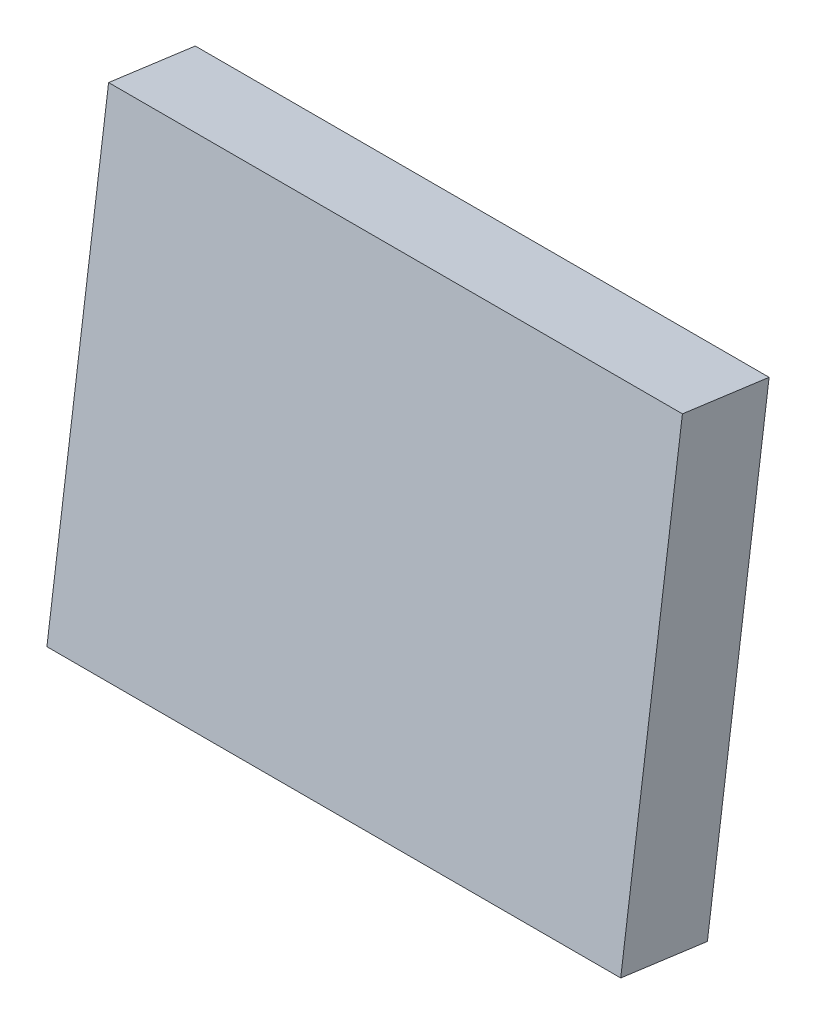
ISO-10303-21;
HEADER;
FILE_DESCRIPTION(('STEP AP214'),'2;1');
FILE_NAME('part.step','',(''),(''),'','','');
FILE_SCHEMA(('AUTOMOTIVE_DESIGN { 1 0 10303 214 1 1 1 1 }'));
ENDSEC;
DATA;
#1=APPLICATION_CONTEXT('core data for automotive mechanical design processes');
#2=APPLICATION_PROTOCOL_DEFINITION('international standard','automotive_design',2000,#1);
#3=PRODUCT_CONTEXT('',#1,'mechanical');
#4=PRODUCT('Part','Part','',(#3));
#5=PRODUCT_RELATED_PRODUCT_CATEGORY('part','',(#4));
#6=PRODUCT_DEFINITION_FORMATION('','',#4);
#7=PRODUCT_DEFINITION_CONTEXT('part definition',#1,'design');
#8=PRODUCT_DEFINITION('design','',#6,#7);
#9=PRODUCT_DEFINITION_SHAPE('','',#8);
#10=(LENGTH_UNIT() NAMED_UNIT(*) SI_UNIT(.MILLI.,.METRE.));
#11=(NAMED_UNIT(*) PLANE_ANGLE_UNIT() SI_UNIT($,.RADIAN.));
#12=(NAMED_UNIT(*) SI_UNIT($,.STERADIAN.) SOLID_ANGLE_UNIT());
#13=UNCERTAINTY_MEASURE_WITH_UNIT(LENGTH_MEASURE(1.E-05),#10,'distance_accuracy_value','');
#14=(GEOMETRIC_REPRESENTATION_CONTEXT(3) GLOBAL_UNCERTAINTY_ASSIGNED_CONTEXT((#13)) GLOBAL_UNIT_ASSIGNED_CONTEXT((#10,
#11,#12)) REPRESENTATION_CONTEXT('',''));
#15=CARTESIAN_POINT('',(0.,0.,0.));
#16=DIRECTION('',(0.,0.,1.));
#17=DIRECTION('',(1.,0.,0.));
#18=AXIS2_PLACEMENT_3D('',#15,#16,#17);
#19=CARTESIAN_POINT('',(-68.5919402962882,-126.218111745127,-943.902118141965));
#20=DIRECTION('',(0.,-0.99103456450642,0.133605733236152));
#21=DIRECTION('',(0.,-0.133605733236152,-0.99103456450642));
#22=AXIS2_PLACEMENT_3D('',#19,#20,#21);
#23=PLANE('',#22);
#24=DIRECTION('',(1.,0.,0.));
#25=VECTOR('',#24,1.);
#26=CARTESIAN_POINT('',(-68.5919402962882,-125.550083078947,-938.946945319433));
#27=LINE('',#26,#25);
#28=CARTESIAN_POINT('',(-68.5919402962882,-125.550083078947,-938.946945319433));
#29=VERTEX_POINT('',#28);
#30=CARTESIAN_POINT('',(-35.7919402962882,-125.550083078947,-938.946945319433));
#31=VERTEX_POINT('',#30);
#32=EDGE_CURVE('E96',#29,#31,#27,.T.);
#33=ORIENTED_EDGE('',*,*,#32,.T.);
#34=DIRECTION('',(0.,0.133605733236152,0.99103456450642));
#35=VECTOR('',#34,1.);
#36=CARTESIAN_POINT('',(-35.7919402962882,-126.218111745127,-943.902118141965));
#37=LINE('',#36,#35);
#38=CARTESIAN_POINT('',(-35.7919402962882,-126.218111745127,-943.902118141965));
#39=VERTEX_POINT('',#38);
#40=EDGE_CURVE('E11',#39,#31,#37,.T.);
#41=ORIENTED_EDGE('',*,*,#40,.F.);
#42=DIRECTION('',(1.,0.,0.));
#43=VECTOR('',#42,1.);
#44=CARTESIAN_POINT('',(-68.5919402962882,-126.218111745127,-943.902118141965));
#45=LINE('',#44,#43);
#46=CARTESIAN_POINT('',(-68.5919402962882,-126.218111745127,-943.902118141965));
#47=VERTEX_POINT('',#46);
#48=EDGE_CURVE('E84',#47,#39,#45,.T.);
#49=ORIENTED_EDGE('',*,*,#48,.F.);
#50=DIRECTION('',(0.,0.133605733236152,0.99103456450642));
#51=VECTOR('',#50,1.);
#52=CARTESIAN_POINT('',(-68.5919402962882,-126.218111745127,-943.902118141965));
#53=LINE('',#52,#51);
#54=EDGE_CURVE('E92',#47,#29,#53,.T.);
#55=ORIENTED_EDGE('',*,*,#54,.T.);
#56=EDGE_LOOP('',(#33,#41,#49,#55));
#57=FACE_BOUND('',#56,.T.);
#58=ADVANCED_FACE('F33',(#57),#23,.F.);
#59=CARTESIAN_POINT('',(-35.7919402962882,-126.218111745127,-943.902118141965));
#60=DIRECTION('',(-1.,0.,0.));
#61=DIRECTION('',(0.,0.,1.));
#62=AXIS2_PLACEMENT_3D('',#59,#60,#61);
#63=PLANE('',#62);
#64=DIRECTION('',(0.,-0.99103456450642,0.133605733236152));
#65=VECTOR('',#64,1.);
#66=CARTESIAN_POINT('',(-35.7919402962882,-125.550083078947,-938.946945319433));
#67=LINE('',#66,#65);
#68=CARTESIAN_POINT('',(-35.7919402962882,-151.713395581916,-935.419753961999));
#69=VERTEX_POINT('',#68);
#70=EDGE_CURVE('E88',#31,#69,#67,.T.);
#71=ORIENTED_EDGE('',*,*,#70,.T.);
#72=DIRECTION('',(0.,0.133605733236152,0.99103456450642));
#73=VECTOR('',#72,1.);
#74=CARTESIAN_POINT('',(-35.7919402962882,-152.381424248097,-940.374926784531));
#75=LINE('',#74,#73);
#76=CARTESIAN_POINT('',(-35.7919402962882,-152.381424248097,-940.374926784531));
#77=VERTEX_POINT('',#76);
#78=EDGE_CURVE('E41',#77,#69,#75,.T.);
#79=ORIENTED_EDGE('',*,*,#78,.F.);
#80=DIRECTION('',(0.,-0.99103456450642,0.133605733236152));
#81=VECTOR('',#80,1.);
#82=CARTESIAN_POINT('',(-35.7919402962882,-126.218111745127,-943.902118141965));
#83=LINE('',#82,#81);
#84=EDGE_CURVE('E79',#39,#77,#83,.T.);
#85=ORIENTED_EDGE('',*,*,#84,.F.);
#86=ORIENTED_EDGE('',*,*,#40,.T.);
#87=EDGE_LOOP('',(#71,#79,#85,#86));
#88=FACE_BOUND('',#87,.T.);
#89=ADVANCED_FACE('F87',(#88),#63,.F.);
#90=CARTESIAN_POINT('',(-68.5919402962882,-152.381424248097,-940.374926784531));
#91=DIRECTION('',(0.,0.99103456450642,-0.133605733236152));
#92=DIRECTION('',(0.,0.133605733236152,0.99103456450642));
#93=AXIS2_PLACEMENT_3D('',#90,#91,#92);
#94=PLANE('',#93);
#95=DIRECTION('',(-1.,0.,0.));
#96=VECTOR('',#95,1.);
#97=CARTESIAN_POINT('',(-68.5919402962882,-151.713395581916,-935.419753961999));
#98=LINE('',#97,#96);
#99=CARTESIAN_POINT('',(-68.5919402962882,-151.713395581916,-935.419753961999));
#100=VERTEX_POINT('',#99);
#101=EDGE_CURVE('E66',#69,#100,#98,.T.);
#102=ORIENTED_EDGE('',*,*,#101,.T.);
#103=DIRECTION('',(0.,0.133605733236152,0.99103456450642));
#104=VECTOR('',#103,1.);
#105=CARTESIAN_POINT('',(-68.5919402962882,-152.381424248097,-940.374926784531));
#106=LINE('',#105,#104);
#107=CARTESIAN_POINT('',(-68.5919402962882,-152.381424248097,-940.374926784531));
#108=VERTEX_POINT('',#107);
#109=EDGE_CURVE('E89',#108,#100,#106,.T.);
#110=ORIENTED_EDGE('',*,*,#109,.F.);
#111=DIRECTION('',(-1.,0.,0.));
#112=VECTOR('',#111,1.);
#113=CARTESIAN_POINT('',(-68.5919402962882,-152.381424248097,-940.374926784531));
#114=LINE('',#113,#112);
#115=EDGE_CURVE('E82',#77,#108,#114,.T.);
#116=ORIENTED_EDGE('',*,*,#115,.F.);
#117=ORIENTED_EDGE('',*,*,#78,.T.);
#118=EDGE_LOOP('',(#102,#110,#116,#117));
#119=FACE_BOUND('',#118,.T.);
#120=ADVANCED_FACE('F90',(#119),#94,.F.);
#121=CARTESIAN_POINT('',(-68.5919402962882,-126.218111745127,-943.902118141965));
#122=DIRECTION('',(1.,0.,0.));
#123=DIRECTION('',(0.,0.,-1.));
#124=AXIS2_PLACEMENT_3D('',#121,#122,#123);
#125=PLANE('',#124);
#126=DIRECTION('',(0.,0.99103456450642,-0.133605733236152));
#127=VECTOR('',#126,1.);
#128=CARTESIAN_POINT('',(-68.5919402962882,-125.550083078947,-938.946945319433));
#129=LINE('',#128,#127);
#130=EDGE_CURVE('E72',#100,#29,#129,.T.);
#131=ORIENTED_EDGE('',*,*,#130,.T.);
#132=ORIENTED_EDGE('',*,*,#54,.F.);
#133=DIRECTION('',(0.,0.99103456450642,-0.133605733236152));
#134=VECTOR('',#133,1.);
#135=CARTESIAN_POINT('',(-68.5919402962882,-126.218111745127,-943.902118141965));
#136=LINE('',#135,#134);
#137=EDGE_CURVE('E49',#108,#47,#136,.T.);
#138=ORIENTED_EDGE('',*,*,#137,.F.);
#139=ORIENTED_EDGE('',*,*,#109,.T.);
#140=EDGE_LOOP('',(#131,#132,#138,#139));
#141=FACE_BOUND('',#140,.T.);
#142=ADVANCED_FACE('F103',(#141),#125,.F.);
#143=CARTESIAN_POINT('',(-3.30394039503722E-12,-127.233152329533,-943.765276051487));
#144=DIRECTION('',(0.,-0.133605733236152,-0.991034564506421));
#145=DIRECTION('',(0.,0.99103456450642,-0.133605733236152));
#146=AXIS2_PLACEMENT_3D('',#143,#144,#145);
#147=PLANE('',#146);
#148=ORIENTED_EDGE('',*,*,#48,.T.);
#149=ORIENTED_EDGE('',*,*,#84,.T.);
#150=ORIENTED_EDGE('',*,*,#115,.T.);
#151=ORIENTED_EDGE('',*,*,#137,.T.);
#152=EDGE_LOOP('',(#148,#149,#150,#151));
#153=FACE_BOUND('',#152,.T.);
#154=ADVANCED_FACE('F80',(#153),#147,.T.);
#155=CARTESIAN_POINT('',(-3.28480936267348E-12,-126.565123663352,-938.810103228955));
#156=DIRECTION('',(0.,-0.133605733236152,-0.991034564506421));
#157=DIRECTION('',(0.,0.99103456450642,-0.133605733236152));
#158=AXIS2_PLACEMENT_3D('',#155,#156,#157);
#159=PLANE('',#158);
#160=ORIENTED_EDGE('',*,*,#32,.F.);
#161=ORIENTED_EDGE('',*,*,#130,.F.);
#162=ORIENTED_EDGE('',*,*,#101,.F.);
#163=ORIENTED_EDGE('',*,*,#70,.F.);
#164=EDGE_LOOP('',(#160,#161,#162,#163));
#165=FACE_BOUND('',#164,.T.);
#166=ADVANCED_FACE('F106',(#165),#159,.F.);
#167=CLOSED_SHELL('',(#58,#89,#120,#142,#154,#166));
#168=MANIFOLD_SOLID_BREP('B2',#167);
#169=ADVANCED_BREP_SHAPE_REPRESENTATION('',(#18,#168),#14);
#170=SHAPE_DEFINITION_REPRESENTATION(#9,#169);
ENDSEC;
END-ISO-10303-21;
